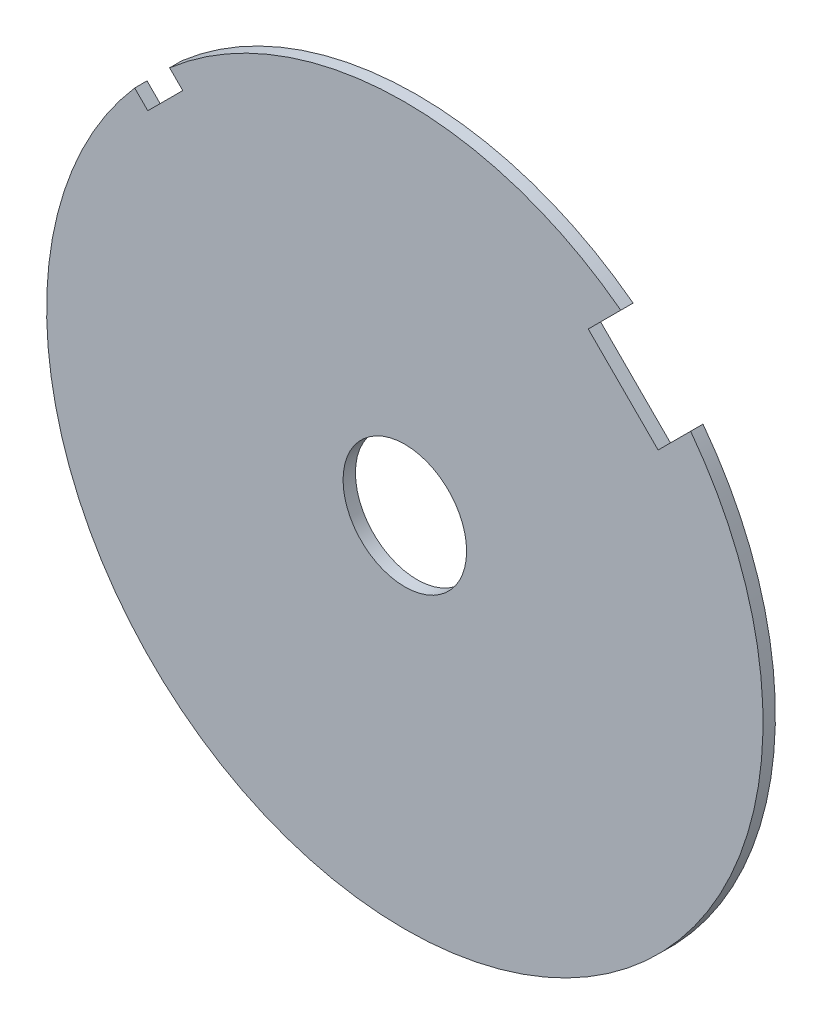
ISO-10303-21;
HEADER;
FILE_DESCRIPTION(('STEP AP214'),'2;1');
FILE_NAME('part.step','',(''),(''),'','','');
FILE_SCHEMA(('AUTOMOTIVE_DESIGN { 1 0 10303 214 1 1 1 1 }'));
ENDSEC;
DATA;
#1=APPLICATION_CONTEXT('core data for automotive mechanical design processes');
#2=APPLICATION_PROTOCOL_DEFINITION('international standard','automotive_design',2000,#1);
#3=PRODUCT_CONTEXT('',#1,'mechanical');
#4=PRODUCT('Part','Part','',(#3));
#5=PRODUCT_RELATED_PRODUCT_CATEGORY('part','',(#4));
#6=PRODUCT_DEFINITION_FORMATION('','',#4);
#7=PRODUCT_DEFINITION_CONTEXT('part definition',#1,'design');
#8=PRODUCT_DEFINITION('design','',#6,#7);
#9=PRODUCT_DEFINITION_SHAPE('','',#8);
#10=(LENGTH_UNIT() NAMED_UNIT(*) SI_UNIT(.MILLI.,.METRE.));
#11=(NAMED_UNIT(*) PLANE_ANGLE_UNIT() SI_UNIT($,.RADIAN.));
#12=(NAMED_UNIT(*) SI_UNIT($,.STERADIAN.) SOLID_ANGLE_UNIT());
#13=UNCERTAINTY_MEASURE_WITH_UNIT(LENGTH_MEASURE(1.E-05),#10,'distance_accuracy_value','');
#14=(GEOMETRIC_REPRESENTATION_CONTEXT(3) GLOBAL_UNCERTAINTY_ASSIGNED_CONTEXT((#13)) GLOBAL_UNIT_ASSIGNED_CONTEXT((#10,
#11,#12)) REPRESENTATION_CONTEXT('',''));
#15=CARTESIAN_POINT('',(0.,0.,0.));
#16=DIRECTION('',(0.,0.,1.));
#17=DIRECTION('',(1.,0.,0.));
#18=AXIS2_PLACEMENT_3D('',#15,#16,#17);
#19=CARTESIAN_POINT('',(0.,0.,-0.25));
#20=DIRECTION('',(0.,0.,1.));
#21=DIRECTION('',(1.,0.,0.));
#22=AXIS2_PLACEMENT_3D('',#19,#20,#21);
#23=CYLINDRICAL_SURFACE('',#22,7.25);
#24=CARTESIAN_POINT('',(0.,0.,-0.25));
#25=DIRECTION('',(0.,0.,1.));
#26=DIRECTION('',(1.,0.,0.));
#27=AXIS2_PLACEMENT_3D('',#24,#25,#26);
#28=CIRCLE('',#27,7.25);
#29=CARTESIAN_POINT('',(4.37041722171094,5.78463078408402,-0.25));
#30=VERTEX_POINT('',#29);
#31=CARTESIAN_POINT('',(-4.76076474577643,5.46787152696296,-0.25));
#32=VERTEX_POINT('',#31);
#33=EDGE_CURVE('E11',#30,#32,#28,.T.);
#34=ORIENTED_EDGE('',*,*,#33,.T.);
#35=DIRECTION('',(0.,0.,-1.));
#36=VECTOR('',#35,1.);
#37=CARTESIAN_POINT('',(-4.76076474577643,5.46787152696296,-0.25));
#38=LINE('',#37,#36);
#39=CARTESIAN_POINT('',(-4.76076474577643,5.46787152696296,0.));
#40=VERTEX_POINT('',#39);
#41=EDGE_CURVE('E138',#32,#40,#38,.F.);
#42=ORIENTED_EDGE('',*,*,#41,.T.);
#43=CARTESIAN_POINT('',(0.,0.,0.));
#44=DIRECTION('',(0.,0.,1.));
#45=DIRECTION('',(1.,0.,0.));
#46=AXIS2_PLACEMENT_3D('',#43,#44,#45);
#47=CIRCLE('',#46,7.25);
#48=CARTESIAN_POINT('',(4.37041722171094,5.78463078408402,0.));
#49=VERTEX_POINT('',#48);
#50=EDGE_CURVE('E168',#49,#40,#47,.T.);
#51=ORIENTED_EDGE('',*,*,#50,.F.);
#52=DIRECTION('',(0.,0.,1.));
#53=VECTOR('',#52,1.);
#54=CARTESIAN_POINT('',(4.37041722171094,5.78463078408402,0.));
#55=LINE('',#54,#53);
#56=EDGE_CURVE('E159',#49,#30,#55,.F.);
#57=ORIENTED_EDGE('',*,*,#56,.T.);
#58=EDGE_LOOP('',(#34,#42,#51,#57));
#59=FACE_BOUND('',#58,.T.);
#60=ADVANCED_FACE('F40',(#59),#23,.T.);
#61=CARTESIAN_POINT('',(-5.46787152696298,4.76076474577641,0.));
#62=VERTEX_POINT('',#61);
#63=CARTESIAN_POINT('',(5.78463078408404,4.37041722171091,0.));
#64=VERTEX_POINT('',#63);
#65=EDGE_CURVE('E169',#62,#64,#47,.T.);
#66=ORIENTED_EDGE('',*,*,#65,.F.);
#67=DIRECTION('',(0.,0.,-1.));
#68=VECTOR('',#67,1.);
#69=CARTESIAN_POINT('',(-5.46787152696298,4.76076474577641,-0.25));
#70=LINE('',#69,#68);
#71=CARTESIAN_POINT('',(-5.46787152696298,4.76076474577641,-0.25));
#72=VERTEX_POINT('',#71);
#73=EDGE_CURVE('E56',#72,#62,#70,.F.);
#74=ORIENTED_EDGE('',*,*,#73,.F.);
#75=CARTESIAN_POINT('',(5.78463078408404,4.37041722171091,-0.25));
#76=VERTEX_POINT('',#75);
#77=EDGE_CURVE('E48',#72,#76,#28,.T.);
#78=ORIENTED_EDGE('',*,*,#77,.T.);
#79=DIRECTION('',(0.,0.,1.));
#80=VECTOR('',#79,1.);
#81=CARTESIAN_POINT('',(5.78463078408404,4.37041722171091,0.));
#82=LINE('',#81,#80);
#83=EDGE_CURVE('E162',#64,#76,#82,.F.);
#84=ORIENTED_EDGE('',*,*,#83,.F.);
#85=EDGE_LOOP('',(#66,#74,#78,#84));
#86=FACE_BOUND('',#85,.T.);
#87=ADVANCED_FACE('F187',(#86),#23,.T.);
#88=CARTESIAN_POINT('',(0.,0.,-0.25));
#89=DIRECTION('',(0.,0.,1.));
#90=DIRECTION('',(1.,0.,0.));
#91=AXIS2_PLACEMENT_3D('',#88,#89,#90);
#92=PLANE('',#91);
#93=CARTESIAN_POINT('',(0.,0.,-0.25));
#94=DIRECTION('',(0.,0.,-1.));
#95=DIRECTION('',(-1.,0.,0.));
#96=AXIS2_PLACEMENT_3D('',#93,#94,#95);
#97=CIRCLE('',#96,1.25);
#98=CARTESIAN_POINT('',(-1.25,0.,-0.25));
#99=VERTEX_POINT('',#98);
#100=EDGE_CURVE('E165',#99,#99,#97,.T.);
#101=ORIENTED_EDGE('',*,*,#100,.F.);
#102=EDGE_LOOP('',(#101));
#103=FACE_BOUND('',#102,.T.);
#104=DIRECTION('',(-0.707106781186545,0.70710678118655,0.));
#105=VECTOR('',#104,1.);
#106=CARTESIAN_POINT('',(0.35355339059325,0.353553390593248,-0.25));
#107=LINE('',#106,#105);
#108=CARTESIAN_POINT('',(-4.4949321977116,5.20203897889813,-0.25));
#109=VERTEX_POINT('',#108);
#110=EDGE_CURVE('E133',#109,#32,#107,.T.);
#111=ORIENTED_EDGE('',*,*,#110,.T.);
#112=ORIENTED_EDGE('',*,*,#33,.F.);
#113=DIRECTION('',(-0.707106781186548,-0.707106781186547,0.));
#114=VECTOR('',#113,1.);
#115=CARTESIAN_POINT('',(-0.707106781186543,0.707106781186545,-0.25));
#116=LINE('',#115,#114);
#117=CARTESIAN_POINT('',(3.71231060122938,5.12652416360246,-0.25));
#118=VERTEX_POINT('',#117);
#119=EDGE_CURVE('E147',#30,#118,#116,.T.);
#120=ORIENTED_EDGE('',*,*,#119,.T.);
#121=DIRECTION('',(0.707106781186546,-0.707106781186549,0.));
#122=VECTOR('',#121,1.);
#123=CARTESIAN_POINT('',(5.12652416360248,3.71231060122936,-0.25));
#124=LINE('',#123,#122);
#125=CARTESIAN_POINT('',(5.12652416360248,3.71231060122936,-0.25));
#126=VERTEX_POINT('',#125);
#127=EDGE_CURVE('E142',#118,#126,#124,.T.);
#128=ORIENTED_EDGE('',*,*,#127,.T.);
#129=DIRECTION('',(0.707106781186552,0.707106781186543,0.));
#130=VECTOR('',#129,1.);
#131=CARTESIAN_POINT('',(5.83363094478903,4.4194173824159,-0.25));
#132=LINE('',#131,#130);
#133=EDGE_CURVE('E145',#126,#76,#132,.T.);
#134=ORIENTED_EDGE('',*,*,#133,.T.);
#135=ORIENTED_EDGE('',*,*,#77,.F.);
#136=DIRECTION('',(0.70710678118655,-0.707106781186545,0.));
#137=VECTOR('',#136,1.);
#138=CARTESIAN_POINT('',(-0.353553390593266,-0.353553390593268,-0.25));
#139=LINE('',#138,#137);
#140=CARTESIAN_POINT('',(-5.20203897889815,4.49493219771158,-0.25));
#141=VERTEX_POINT('',#140);
#142=EDGE_CURVE('E131',#72,#141,#139,.T.);
#143=ORIENTED_EDGE('',*,*,#142,.T.);
#144=DIRECTION('',(0.707106781186546,0.707106781186549,0.));
#145=VECTOR('',#144,1.);
#146=CARTESIAN_POINT('',(-4.84848558830488,4.84848558830486,-0.25));
#147=LINE('',#146,#145);
#148=EDGE_CURVE('E114',#141,#109,#147,.T.);
#149=ORIENTED_EDGE('',*,*,#148,.T.);
#150=EDGE_LOOP('',(#111,#112,#120,#128,#134,#135,#143,#149));
#151=FACE_BOUND('',#150,.T.);
#152=ADVANCED_FACE('F180',(#103,#151),#92,.F.);
#153=CARTESIAN_POINT('',(0.,0.,0.));
#154=DIRECTION('',(0.,0.,1.));
#155=DIRECTION('',(1.,0.,0.));
#156=AXIS2_PLACEMENT_3D('',#153,#154,#155);
#157=PLANE('',#156);
#158=CARTESIAN_POINT('',(0.,0.,0.));
#159=DIRECTION('',(0.,0.,1.));
#160=DIRECTION('',(1.,0.,0.));
#161=AXIS2_PLACEMENT_3D('',#158,#159,#160);
#162=CIRCLE('',#161,1.25);
#163=CARTESIAN_POINT('',(1.25,0.,0.));
#164=VERTEX_POINT('',#163);
#165=EDGE_CURVE('E43',#164,#164,#162,.T.);
#166=ORIENTED_EDGE('',*,*,#165,.F.);
#167=EDGE_LOOP('',(#166));
#168=FACE_BOUND('',#167,.T.);
#169=ORIENTED_EDGE('',*,*,#50,.T.);
#170=DIRECTION('',(-0.707106781186545,0.70710678118655,0.));
#171=VECTOR('',#170,1.);
#172=CARTESIAN_POINT('',(0.35355339059325,0.353553390593248,0.));
#173=LINE('',#172,#171);
#174=CARTESIAN_POINT('',(-4.4949321977116,5.20203897889813,0.));
#175=VERTEX_POINT('',#174);
#176=EDGE_CURVE('E113',#175,#40,#173,.T.);
#177=ORIENTED_EDGE('',*,*,#176,.F.);
#178=DIRECTION('',(0.707106781186546,0.707106781186549,0.));
#179=VECTOR('',#178,1.);
#180=CARTESIAN_POINT('',(-4.84848558830488,4.84848558830486,0.));
#181=LINE('',#180,#179);
#182=CARTESIAN_POINT('',(-5.20203897889815,4.49493219771158,0.));
#183=VERTEX_POINT('',#182);
#184=EDGE_CURVE('E119',#183,#175,#181,.T.);
#185=ORIENTED_EDGE('',*,*,#184,.F.);
#186=DIRECTION('',(0.70710678118655,-0.707106781186545,0.));
#187=VECTOR('',#186,1.);
#188=CARTESIAN_POINT('',(-0.353553390593266,-0.353553390593268,0.));
#189=LINE('',#188,#187);
#190=EDGE_CURVE('E105',#62,#183,#189,.T.);
#191=ORIENTED_EDGE('',*,*,#190,.F.);
#192=ORIENTED_EDGE('',*,*,#65,.T.);
#193=DIRECTION('',(0.707106781186552,0.707106781186543,0.));
#194=VECTOR('',#193,1.);
#195=CARTESIAN_POINT('',(5.83363094478903,4.4194173824159,0.));
#196=LINE('',#195,#194);
#197=CARTESIAN_POINT('',(5.12652416360248,3.71231060122936,0.));
#198=VERTEX_POINT('',#197);
#199=EDGE_CURVE('E153',#198,#64,#196,.T.);
#200=ORIENTED_EDGE('',*,*,#199,.F.);
#201=DIRECTION('',(0.707106781186546,-0.707106781186549,0.));
#202=VECTOR('',#201,1.);
#203=CARTESIAN_POINT('',(5.12652416360248,3.71231060122936,0.));
#204=LINE('',#203,#202);
#205=CARTESIAN_POINT('',(3.71231060122938,5.12652416360246,0.));
#206=VERTEX_POINT('',#205);
#207=EDGE_CURVE('E140',#206,#198,#204,.T.);
#208=ORIENTED_EDGE('',*,*,#207,.F.);
#209=DIRECTION('',(-0.707106781186548,-0.707106781186547,0.));
#210=VECTOR('',#209,1.);
#211=CARTESIAN_POINT('',(-0.707106781186543,0.707106781186545,0.));
#212=LINE('',#211,#210);
#213=EDGE_CURVE('E146',#49,#206,#212,.T.);
#214=ORIENTED_EDGE('',*,*,#213,.F.);
#215=EDGE_LOOP('',(#169,#177,#185,#191,#192,#200,#208,#214));
#216=FACE_BOUND('',#215,.T.);
#217=ADVANCED_FACE('F126',(#168,#216),#157,.T.);
#218=CARTESIAN_POINT('',(0.,0.,9.75));
#219=DIRECTION('',(0.,0.,-1.));
#220=DIRECTION('',(-1.,0.,0.));
#221=AXIS2_PLACEMENT_3D('',#218,#219,#220);
#222=CYLINDRICAL_SURFACE('',#221,1.25);
#223=ORIENTED_EDGE('',*,*,#165,.T.);
#224=EDGE_LOOP('',(#223));
#225=FACE_BOUND('',#224,.T.);
#226=ORIENTED_EDGE('',*,*,#100,.T.);
#227=EDGE_LOOP('',(#226));
#228=FACE_BOUND('',#227,.T.);
#229=ADVANCED_FACE('F176',(#225,#228),#222,.F.);
#230=CARTESIAN_POINT('',(-0.707106781186543,0.707106781186545,0.));
#231=DIRECTION('',(-0.707106781186547,0.707106781186548,0.));
#232=DIRECTION('',(-0.707106781186548,-0.707106781186547,0.));
#233=AXIS2_PLACEMENT_3D('',#230,#231,#232);
#234=PLANE('',#233);
#235=ORIENTED_EDGE('',*,*,#56,.F.);
#236=ORIENTED_EDGE('',*,*,#213,.T.);
#237=DIRECTION('',(0.,0.,1.));
#238=VECTOR('',#237,1.);
#239=CARTESIAN_POINT('',(3.71231060122938,5.12652416360246,0.));
#240=LINE('',#239,#238);
#241=EDGE_CURVE('E156',#206,#118,#240,.F.);
#242=ORIENTED_EDGE('',*,*,#241,.T.);
#243=ORIENTED_EDGE('',*,*,#119,.F.);
#244=EDGE_LOOP('',(#235,#236,#242,#243));
#245=FACE_BOUND('',#244,.T.);
#246=ADVANCED_FACE('F185',(#245),#234,.F.);
#247=CARTESIAN_POINT('',(5.12652416360248,3.71231060122936,0.));
#248=DIRECTION('',(-0.707106781186549,-0.707106781186546,0.));
#249=DIRECTION('',(0.707106781186546,-0.707106781186549,0.));
#250=AXIS2_PLACEMENT_3D('',#247,#248,#249);
#251=PLANE('',#250);
#252=ORIENTED_EDGE('',*,*,#241,.F.);
#253=ORIENTED_EDGE('',*,*,#207,.T.);
#254=DIRECTION('',(0.,0.,1.));
#255=VECTOR('',#254,1.);
#256=CARTESIAN_POINT('',(5.12652416360248,3.71231060122936,0.));
#257=LINE('',#256,#255);
#258=EDGE_CURVE('E64',#198,#126,#257,.F.);
#259=ORIENTED_EDGE('',*,*,#258,.T.);
#260=ORIENTED_EDGE('',*,*,#127,.F.);
#261=EDGE_LOOP('',(#252,#253,#259,#260));
#262=FACE_BOUND('',#261,.T.);
#263=ADVANCED_FACE('F208',(#262),#251,.F.);
#264=CARTESIAN_POINT('',(5.83363094478903,4.4194173824159,0.));
#265=DIRECTION('',(0.707106781186543,-0.707106781186552,0.));
#266=DIRECTION('',(0.707106781186552,0.707106781186543,0.));
#267=AXIS2_PLACEMENT_3D('',#264,#265,#266);
#268=PLANE('',#267);
#269=ORIENTED_EDGE('',*,*,#199,.T.);
#270=ORIENTED_EDGE('',*,*,#83,.T.);
#271=ORIENTED_EDGE('',*,*,#133,.F.);
#272=ORIENTED_EDGE('',*,*,#258,.F.);
#273=EDGE_LOOP('',(#269,#270,#271,#272));
#274=FACE_BOUND('',#273,.T.);
#275=ADVANCED_FACE('F201',(#274),#268,.F.);
#276=CARTESIAN_POINT('',(0.35355339059325,0.353553390593248,-0.25));
#277=DIRECTION('',(0.70710678118655,0.707106781186545,0.));
#278=DIRECTION('',(-0.707106781186545,0.70710678118655,0.));
#279=AXIS2_PLACEMENT_3D('',#276,#277,#278);
#280=PLANE('',#279);
#281=ORIENTED_EDGE('',*,*,#41,.F.);
#282=ORIENTED_EDGE('',*,*,#110,.F.);
#283=DIRECTION('',(0.,0.,-1.));
#284=VECTOR('',#283,1.);
#285=CARTESIAN_POINT('',(-4.4949321977116,5.20203897889813,-0.25));
#286=LINE('',#285,#284);
#287=EDGE_CURVE('E122',#109,#175,#286,.F.);
#288=ORIENTED_EDGE('',*,*,#287,.T.);
#289=ORIENTED_EDGE('',*,*,#176,.T.);
#290=EDGE_LOOP('',(#281,#282,#288,#289));
#291=FACE_BOUND('',#290,.T.);
#292=ADVANCED_FACE('F199',(#291),#280,.F.);
#293=CARTESIAN_POINT('',(-4.84848558830488,4.84848558830486,-0.25));
#294=DIRECTION('',(0.707106781186549,-0.707106781186546,0.));
#295=DIRECTION('',(0.707106781186546,0.707106781186549,0.));
#296=AXIS2_PLACEMENT_3D('',#293,#294,#295);
#297=PLANE('',#296);
#298=ORIENTED_EDGE('',*,*,#287,.F.);
#299=ORIENTED_EDGE('',*,*,#148,.F.);
#300=DIRECTION('',(0.,0.,-1.));
#301=VECTOR('',#300,1.);
#302=CARTESIAN_POINT('',(-5.20203897889815,4.49493219771158,-0.25));
#303=LINE('',#302,#301);
#304=EDGE_CURVE('E108',#141,#183,#303,.F.);
#305=ORIENTED_EDGE('',*,*,#304,.T.);
#306=ORIENTED_EDGE('',*,*,#184,.T.);
#307=EDGE_LOOP('',(#298,#299,#305,#306));
#308=FACE_BOUND('',#307,.T.);
#309=ADVANCED_FACE('F118',(#308),#297,.F.);
#310=CARTESIAN_POINT('',(-0.353553390593266,-0.353553390593268,-0.25));
#311=DIRECTION('',(-0.707106781186545,-0.70710678118655,0.));
#312=DIRECTION('',(0.70710678118655,-0.707106781186545,0.));
#313=AXIS2_PLACEMENT_3D('',#310,#311,#312);
#314=PLANE('',#313);
#315=ORIENTED_EDGE('',*,*,#304,.F.);
#316=ORIENTED_EDGE('',*,*,#142,.F.);
#317=ORIENTED_EDGE('',*,*,#73,.T.);
#318=ORIENTED_EDGE('',*,*,#190,.T.);
#319=EDGE_LOOP('',(#315,#316,#317,#318));
#320=FACE_BOUND('',#319,.T.);
#321=ADVANCED_FACE('F107',(#320),#314,.F.);
#322=CLOSED_SHELL('',(#60,#87,#152,#217,#229,#246,#263,#275,#292,#309,#321));
#323=MANIFOLD_SOLID_BREP('B2',#322);
#324=ADVANCED_BREP_SHAPE_REPRESENTATION('',(#18,#323),#14);
#325=SHAPE_DEFINITION_REPRESENTATION(#9,#324);
ENDSEC;
END-ISO-10303-21;
